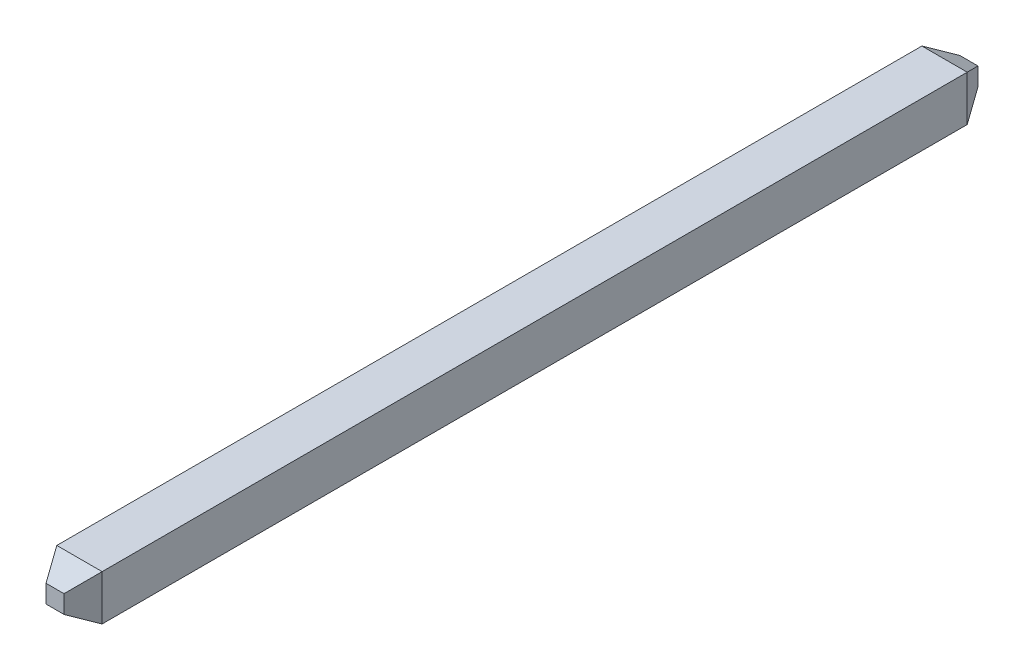
ISO-10303-21;
HEADER;
FILE_DESCRIPTION(('STEP AP214'),'2;1');
FILE_NAME('part.step','',(''),(''),'','','');
FILE_SCHEMA(('AUTOMOTIVE_DESIGN { 1 0 10303 214 1 1 1 1 }'));
ENDSEC;
DATA;
#1=APPLICATION_CONTEXT('core data for automotive mechanical design processes');
#2=APPLICATION_PROTOCOL_DEFINITION('international standard','automotive_design',2000,#1);
#3=PRODUCT_CONTEXT('',#1,'mechanical');
#4=PRODUCT('Part','Part','',(#3));
#5=PRODUCT_RELATED_PRODUCT_CATEGORY('part','',(#4));
#6=PRODUCT_DEFINITION_FORMATION('','',#4);
#7=PRODUCT_DEFINITION_CONTEXT('part definition',#1,'design');
#8=PRODUCT_DEFINITION('design','',#6,#7);
#9=PRODUCT_DEFINITION_SHAPE('','',#8);
#10=(LENGTH_UNIT() NAMED_UNIT(*) SI_UNIT(.MILLI.,.METRE.));
#11=(NAMED_UNIT(*) PLANE_ANGLE_UNIT() SI_UNIT($,.RADIAN.));
#12=(NAMED_UNIT(*) SI_UNIT($,.STERADIAN.) SOLID_ANGLE_UNIT());
#13=UNCERTAINTY_MEASURE_WITH_UNIT(LENGTH_MEASURE(1.E-05),#10,'distance_accuracy_value','');
#14=(GEOMETRIC_REPRESENTATION_CONTEXT(3) GLOBAL_UNCERTAINTY_ASSIGNED_CONTEXT((#13)) GLOBAL_UNIT_ASSIGNED_CONTEXT((#10,
#11,#12)) REPRESENTATION_CONTEXT('',''));
#15=CARTESIAN_POINT('',(0.,0.,0.));
#16=DIRECTION('',(0.,0.,1.));
#17=DIRECTION('',(1.,0.,0.));
#18=AXIS2_PLACEMENT_3D('',#15,#16,#17);
#19=CARTESIAN_POINT('',(0.120115100419239,0.945,-3.20872569516347));
#20=DIRECTION('',(0.872569516347454,0.,-0.488489958076081));
#21=DIRECTION('',(-0.488489958076081,0.,-0.872569516347454));
#22=AXIS2_PLACEMENT_3D('',#19,#20,#21);
#23=PLANE('',#22);
#24=DIRECTION('',(0.,1.,0.));
#25=VECTOR('',#24,1.);
#26=CARTESIAN_POINT('',(0.315341856644683,0.944999999999999,-2.86000017186176));
#27=LINE('',#26,#25);
#28=CARTESIAN_POINT('',(0.315341856632625,0.954999975315067,-2.85999984563027));
#29=VERTEX_POINT('',#28);
#30=CARTESIAN_POINT('',(0.315342017291865,1.58500016035866,-2.8599998849043));
#31=VERTEX_POINT('',#30);
#32=EDGE_CURVE('E118',#29,#31,#27,.T.);
#33=ORIENTED_EDGE('',*,*,#32,.F.);
#34=DIRECTION('',(0.439072617568639,-0.438284036988113,0.784297353956282));
#35=VECTOR('',#34,1.);
#36=CARTESIAN_POINT('',(0.125000000000004,1.145,-3.2));
#37=LINE('',#36,#35);
#38=CARTESIAN_POINT('',(0.125000000000003,1.145,-3.2));
#39=VERTEX_POINT('',#38);
#40=EDGE_CURVE('E116',#39,#29,#37,.T.);
#41=ORIENTED_EDGE('',*,*,#40,.F.);
#42=DIRECTION('',(0.,1.,0.));
#43=VECTOR('',#42,1.);
#44=CARTESIAN_POINT('',(0.125000000000004,1.135,-3.2));
#45=LINE('',#44,#43);
#46=CARTESIAN_POINT('',(0.125000000000003,1.395,-3.2));
#47=VERTEX_POINT('',#46);
#48=EDGE_CURVE('E79',#47,#39,#45,.F.);
#49=ORIENTED_EDGE('',*,*,#48,.F.);
#50=DIRECTION('',(-0.439072617568639,-0.438284036988113,-0.784297353956282));
#51=VECTOR('',#50,1.);
#52=CARTESIAN_POINT('',(0.315341856644679,1.585,-2.86000017186176));
#53=LINE('',#52,#51);
#54=EDGE_CURVE('E110',#31,#47,#53,.T.);
#55=ORIENTED_EDGE('',*,*,#54,.F.);
#56=EDGE_LOOP('',(#33,#41,#49,#55));
#57=FACE_BOUND('',#56,.T.);
#58=ADVANCED_FACE('F17',(#57),#23,.T.);
#59=CARTESIAN_POINT('',(0.12036702814295,0.945,9.50441734607014));
#60=DIRECTION('',(0.873317045523297,0.,0.487152273933377));
#61=DIRECTION('',(0.487152273933377,0.,-0.873317045523297));
#62=AXIS2_PLACEMENT_3D('',#59,#60,#61);
#63=PLANE('',#62);
#64=DIRECTION('',(-0.437799852400895,0.438586917260846,0.784839349959839));
#65=VECTOR('',#64,1.);
#66=CARTESIAN_POINT('',(0.314897899551643,0.954999686828527,9.15568378706484));
#67=LINE('',#66,#65);
#68=CARTESIAN_POINT('',(0.314897654549926,0.954999891076848,9.15568368845102));
#69=VERTEX_POINT('',#68);
#70=CARTESIAN_POINT('',(0.125238550882283,1.145,9.49568417561491));
#71=VERTEX_POINT('',#70);
#72=EDGE_CURVE('E122',#69,#71,#67,.T.);
#73=ORIENTED_EDGE('',*,*,#72,.F.);
#74=DIRECTION('',(0.,1.,0.));
#75=VECTOR('',#74,1.);
#76=CARTESIAN_POINT('',(0.314898539006426,0.944999999999999,9.15568372243698));
#77=LINE('',#76,#75);
#78=CARTESIAN_POINT('',(0.31489765280461,1.5850001770326,9.15568371270385));
#79=VERTEX_POINT('',#78);
#80=EDGE_CURVE('E89',#79,#69,#77,.F.);
#81=ORIENTED_EDGE('',*,*,#80,.F.);
#82=DIRECTION('',(0.437799852400897,0.438586917260845,-0.784839349959839));
#83=VECTOR('',#82,1.);
#84=CARTESIAN_POINT('',(0.125238550882283,1.395,9.49568417561491));
#85=LINE('',#84,#83);
#86=CARTESIAN_POINT('',(0.125238550882283,1.395,9.49568417561491));
#87=VERTEX_POINT('',#86);
#88=EDGE_CURVE('E84',#87,#79,#85,.T.);
#89=ORIENTED_EDGE('',*,*,#88,.F.);
#90=DIRECTION('',(0.,1.,0.));
#91=VECTOR('',#90,1.);
#92=CARTESIAN_POINT('',(0.125238550882283,1.405,9.49568417561491));
#93=LINE('',#92,#91);
#94=EDGE_CURVE('E20',#71,#87,#93,.T.);
#95=ORIENTED_EDGE('',*,*,#94,.F.);
#96=EDGE_LOOP('',(#73,#81,#89,#95));
#97=FACE_BOUND('',#96,.T.);
#98=ADVANCED_FACE('F86',(#97),#63,.T.);
#99=CARTESIAN_POINT('',(-0.134761449117717,1.405,9.49568417561491));
#100=DIRECTION('',(0.,0.,1.));
#101=DIRECTION('',(1.,0.,0.));
#102=AXIS2_PLACEMENT_3D('',#99,#100,#101);
#103=PLANE('',#102);
#104=DIRECTION('',(1.,0.,0.));
#105=VECTOR('',#104,1.);
#106=CARTESIAN_POINT('',(-0.325103305762397,1.395,9.49568417561491));
#107=LINE('',#106,#105);
#108=CARTESIAN_POINT('',(-0.124761449117717,1.395,9.49568417561491));
#109=VERTEX_POINT('',#108);
#110=EDGE_CURVE('E93',#109,#87,#107,.T.);
#111=ORIENTED_EDGE('',*,*,#110,.F.);
#112=DIRECTION('',(0.,1.,0.));
#113=VECTOR('',#112,1.);
#114=CARTESIAN_POINT('',(-0.124761449117719,0.945,9.49568417561491));
#115=LINE('',#114,#113);
#116=CARTESIAN_POINT('',(-0.124761449117718,1.145,9.49568417561491));
#117=VERTEX_POINT('',#116);
#118=EDGE_CURVE('E129',#117,#109,#115,.T.);
#119=ORIENTED_EDGE('',*,*,#118,.F.);
#120=DIRECTION('',(1.,0.,0.));
#121=VECTOR('',#120,1.);
#122=CARTESIAN_POINT('',(-0.325103305762399,1.145,9.49568417561491));
#123=LINE('',#122,#121);
#124=EDGE_CURVE('E98',#71,#117,#123,.F.);
#125=ORIENTED_EDGE('',*,*,#124,.F.);
#126=ORIENTED_EDGE('',*,*,#94,.T.);
#127=EDGE_LOOP('',(#111,#119,#125,#126));
#128=FACE_BOUND('',#127,.T.);
#129=ADVANCED_FACE('F95',(#128),#103,.T.);
#130=CARTESIAN_POINT('',(-0.325103305762397,1.39012178454432,9.50441360938624));
#131=DIRECTION('',(0.,0.872943377132664,0.487821545567864));
#132=DIRECTION('',(0.,-0.487821545567864,0.872943377132664));
#133=AXIS2_PLACEMENT_3D('',#130,#131,#132);
#134=PLANE('',#133);
#135=DIRECTION('',(-0.439072459537935,0.438284700441641,-0.78429707167252));
#136=VECTOR('',#135,1.);
#137=CARTESIAN_POINT('',(-0.124761449117719,1.395,9.49568417561491));
#138=LINE('',#137,#136);
#139=CARTESIAN_POINT('',(-0.315102496297201,1.58500008247257,9.15568447138296));
#140=VERTEX_POINT('',#139);
#141=EDGE_CURVE('E102',#109,#140,#138,.T.);
#142=ORIENTED_EDGE('',*,*,#141,.F.);
#143=ORIENTED_EDGE('',*,*,#110,.T.);
#144=ORIENTED_EDGE('',*,*,#88,.T.);
#145=DIRECTION('',(1.,0.,0.));
#146=VECTOR('',#145,1.);
#147=CARTESIAN_POINT('',(6.65893728155065E-05,1.585,9.15568497320463));
#148=LINE('',#147,#146);
#149=EDGE_CURVE('E131',#140,#79,#148,.T.);
#150=ORIENTED_EDGE('',*,*,#149,.F.);
#151=EDGE_LOOP('',(#142,#143,#144,#150));
#152=FACE_BOUND('',#151,.T.);
#153=ADVANCED_FACE('F100',(#152),#134,.T.);
#154=CARTESIAN_POINT('',(-0.135,1.135,-3.2));
#155=DIRECTION('',(0.,0.,-1.));
#156=DIRECTION('',(-1.,0.,0.));
#157=AXIS2_PLACEMENT_3D('',#154,#155,#156);
#158=PLANE('',#157);
#159=ORIENTED_EDGE('',*,*,#48,.T.);
#160=DIRECTION('',(1.,0.,0.));
#161=VECTOR('',#160,1.);
#162=CARTESIAN_POINT('',(-0.324658143355321,1.145,-3.2));
#163=LINE('',#162,#161);
#164=CARTESIAN_POINT('',(-0.124999999999996,1.145,-3.2));
#165=VERTEX_POINT('',#164);
#166=EDGE_CURVE('E113',#165,#39,#163,.T.);
#167=ORIENTED_EDGE('',*,*,#166,.F.);
#168=DIRECTION('',(0.,1.,0.));
#169=VECTOR('',#168,1.);
#170=CARTESIAN_POINT('',(-0.124999999999998,0.945,-3.2));
#171=LINE('',#170,#169);
#172=CARTESIAN_POINT('',(-0.124999999999996,1.395,-3.2));
#173=VERTEX_POINT('',#172);
#174=EDGE_CURVE('E140',#173,#165,#171,.F.);
#175=ORIENTED_EDGE('',*,*,#174,.F.);
#176=DIRECTION('',(1.,0.,0.));
#177=VECTOR('',#176,1.);
#178=CARTESIAN_POINT('',(-0.32465814335532,1.395,-3.2));
#179=LINE('',#178,#177);
#180=EDGE_CURVE('E105',#47,#173,#179,.F.);
#181=ORIENTED_EDGE('',*,*,#180,.F.);
#182=EDGE_LOOP('',(#159,#167,#175,#181));
#183=FACE_BOUND('',#182,.T.);
#184=ADVANCED_FACE('F184',(#183),#158,.T.);
#185=CARTESIAN_POINT('',(-0.32465814335532,1.58987821545568,-2.85127073809043));
#186=DIRECTION('',(0.,0.872943377132663,-0.487821545567865));
#187=DIRECTION('',(0.,0.487821545567865,0.872943377132663));
#188=AXIS2_PLACEMENT_3D('',#185,#186,#187);
#189=PLANE('',#188);
#190=DIRECTION('',(1.,0.,0.));
#191=VECTOR('',#190,1.);
#192=CARTESIAN_POINT('',(6.65893728155065E-05,1.585,-2.86000017186176));
#193=LINE('',#192,#191);
#194=CARTESIAN_POINT('',(-0.314658552313813,1.5850007068091,-2.8599984305592));
#195=VERTEX_POINT('',#194);
#196=EDGE_CURVE('E137',#31,#195,#193,.F.);
#197=ORIENTED_EDGE('',*,*,#196,.F.);
#198=ORIENTED_EDGE('',*,*,#54,.T.);
#199=ORIENTED_EDGE('',*,*,#180,.T.);
#200=DIRECTION('',(0.437798396819594,-0.438586429089658,-0.784840434713054));
#201=VECTOR('',#200,1.);
#202=CARTESIAN_POINT('',(-0.314659335924682,1.58500072063078,-2.85999803394471));
#203=LINE('',#202,#201);
#204=EDGE_CURVE('E145',#195,#173,#203,.T.);
#205=ORIENTED_EDGE('',*,*,#204,.F.);
#206=EDGE_LOOP('',(#197,#198,#199,#205));
#207=FACE_BOUND('',#206,.T.);
#208=ADVANCED_FACE('F182',(#207),#189,.T.);
#209=CARTESIAN_POINT('',(-0.324658143355321,1.14987821545568,-3.20872943377133));
#210=DIRECTION('',(0.,-0.872943377132663,-0.487821545567865));
#211=DIRECTION('',(0.,0.487821545567865,-0.872943377132663));
#212=AXIS2_PLACEMENT_3D('',#209,#210,#211);
#213=PLANE('',#212);
#214=ORIENTED_EDGE('',*,*,#166,.T.);
#215=ORIENTED_EDGE('',*,*,#40,.T.);
#216=DIRECTION('',(1.,0.,0.));
#217=VECTOR('',#216,1.);
#218=CARTESIAN_POINT('',(-0.325051653144535,0.955,-2.85999756200982));
#219=LINE('',#218,#217);
#220=CARTESIAN_POINT('',(-0.314658017815116,0.954999729763457,-2.85999898491791));
#221=VERTEX_POINT('',#220);
#222=EDGE_CURVE('E35',#221,#29,#219,.T.);
#223=ORIENTED_EDGE('',*,*,#222,.F.);
#224=DIRECTION('',(-0.437798396819593,-0.438586429089662,0.784840434713052));
#225=VECTOR('',#224,1.);
#226=CARTESIAN_POINT('',(-0.124999999999998,1.145,-3.2));
#227=LINE('',#226,#225);
#228=EDGE_CURVE('E143',#165,#221,#227,.T.);
#229=ORIENTED_EDGE('',*,*,#228,.F.);
#230=EDGE_LOOP('',(#214,#215,#223,#229));
#231=FACE_BOUND('',#230,.T.);
#232=ADVANCED_FACE('F185',(#231),#213,.T.);
#233=CARTESIAN_POINT('',(0.315346308268754,0.944999999999999,-2.98065701705514));
#234=DIRECTION('',(0.999999999319383,0.,3.68949151671738E-05));
#235=DIRECTION('',(3.68949151671738E-05,0.,-0.999999999319383));
#236=AXIS2_PLACEMENT_3D('',#233,#234,#235);
#237=PLANE('',#236);
#238=DIRECTION('',(3.69481335093583E-05,0.,-0.999999999317418));
#239=VECTOR('',#238,1.);
#240=CARTESIAN_POINT('',(0.314897899551644,1.585,9.15568372241339));
#241=LINE('',#240,#239);
#242=EDGE_CURVE('E134',#79,#31,#241,.T.);
#243=ORIENTED_EDGE('',*,*,#242,.F.);
#244=ORIENTED_EDGE('',*,*,#80,.T.);
#245=DIRECTION('',(-3.69481335094485E-05,0.,0.999999999317418));
#246=VECTOR('',#245,1.);
#247=CARTESIAN_POINT('',(0.315341856644679,0.955,-2.86000017186176));
#248=LINE('',#247,#246);
#249=EDGE_CURVE('E149',#29,#69,#248,.T.);
#250=ORIENTED_EDGE('',*,*,#249,.F.);
#251=ORIENTED_EDGE('',*,*,#32,.T.);
#252=EDGE_LOOP('',(#243,#244,#250,#251));
#253=FACE_BOUND('',#252,.T.);
#254=ADVANCED_FACE('F187',(#253),#237,.T.);
#255=CARTESIAN_POINT('',(-0.325103305762399,0.950121784544321,9.14695491370534));
#256=DIRECTION('',(0.,-0.872943377132664,0.487821545567865));
#257=DIRECTION('',(0.,-0.487821545567865,-0.872943377132664));
#258=AXIS2_PLACEMENT_3D('',#255,#256,#257);
#259=PLANE('',#258);
#260=ORIENTED_EDGE('',*,*,#124,.T.);
#261=DIRECTION('',(0.439072459537931,0.438284700441657,0.784297071672513));
#262=VECTOR('',#261,1.);
#263=CARTESIAN_POINT('',(-0.315102751134454,0.955000197635095,9.15568533818575));
#264=LINE('',#263,#262);
#265=CARTESIAN_POINT('',(-0.315102182397624,0.955000116075707,9.15568487573228));
#266=VERTEX_POINT('',#265);
#267=EDGE_CURVE('E126',#266,#117,#264,.T.);
#268=ORIENTED_EDGE('',*,*,#267,.F.);
#269=DIRECTION('',(1.,0.,0.));
#270=VECTOR('',#269,1.);
#271=CARTESIAN_POINT('',(-0.325051653144535,0.955,9.15568372241339));
#272=LINE('',#271,#270);
#273=EDGE_CURVE('E152',#69,#266,#272,.F.);
#274=ORIENTED_EDGE('',*,*,#273,.F.);
#275=ORIENTED_EDGE('',*,*,#72,.T.);
#276=EDGE_LOOP('',(#260,#268,#274,#275));
#277=FACE_BOUND('',#276,.T.);
#278=ADVANCED_FACE('F174',(#277),#259,.T.);
#279=CARTESIAN_POINT('',(-0.119876549536956,0.945,9.50440987077839));
#280=DIRECTION('',(-0.872569516347453,0.,0.488489958076082));
#281=DIRECTION('',(0.488489958076082,0.,0.872569516347453));
#282=AXIS2_PLACEMENT_3D('',#279,#280,#281);
#283=PLANE('',#282);
#284=ORIENTED_EDGE('',*,*,#267,.T.);
#285=ORIENTED_EDGE('',*,*,#118,.T.);
#286=ORIENTED_EDGE('',*,*,#141,.T.);
#287=DIRECTION('',(0.,1.,0.));
#288=VECTOR('',#287,1.);
#289=CARTESIAN_POINT('',(-0.315101461039725,0.945,9.15568497322818));
#290=LINE('',#289,#288);
#291=EDGE_CURVE('E155',#266,#140,#290,.T.);
#292=ORIENTED_EDGE('',*,*,#291,.F.);
#293=EDGE_LOOP('',(#284,#285,#286,#292));
#294=FACE_BOUND('',#293,.T.);
#295=ADVANCED_FACE('F177',(#294),#283,.T.);
#296=CARTESIAN_POINT('',(6.65893728155065E-05,1.585,9.32634470275115));
#297=DIRECTION('',(0.,1.,0.));
#298=DIRECTION('',(0.,0.,1.));
#299=AXIS2_PLACEMENT_3D('',#296,#297,#298);
#300=PLANE('',#299);
#301=ORIENTED_EDGE('',*,*,#196,.T.);
#302=DIRECTION('',(-3.68949151674615E-05,0.,0.999999999319383));
#303=VECTOR('',#302,1.);
#304=CARTESIAN_POINT('',(-0.31510775764562,1.5849998023649,9.32634821671993));
#305=LINE('',#304,#303);
#306=EDGE_CURVE('E158',#140,#195,#305,.F.);
#307=ORIENTED_EDGE('',*,*,#306,.F.);
#308=ORIENTED_EDGE('',*,*,#149,.T.);
#309=ORIENTED_EDGE('',*,*,#242,.T.);
#310=EDGE_LOOP('',(#301,#307,#308,#309));
#311=FACE_BOUND('',#310,.T.);
#312=ADVANCED_FACE('F179',(#311),#300,.T.);
#313=CARTESIAN_POINT('',(-0.120128477260666,0.945,-3.20873317045523));
#314=DIRECTION('',(-0.873317045523297,0.,-0.487152273933376));
#315=DIRECTION('',(-0.487152273933376,0.,0.873317045523297));
#316=AXIS2_PLACEMENT_3D('',#313,#314,#315);
#317=PLANE('',#316);
#318=DIRECTION('',(0.,1.,0.));
#319=VECTOR('',#318,1.);
#320=CARTESIAN_POINT('',(-0.314658143451607,0.945,-2.85999756199704));
#321=LINE('',#320,#319);
#322=EDGE_CURVE('E26',#195,#221,#321,.F.);
#323=ORIENTED_EDGE('',*,*,#322,.F.);
#324=ORIENTED_EDGE('',*,*,#204,.T.);
#325=ORIENTED_EDGE('',*,*,#174,.T.);
#326=ORIENTED_EDGE('',*,*,#228,.T.);
#327=EDGE_LOOP('',(#323,#324,#325,#326));
#328=FACE_BOUND('',#327,.T.);
#329=ADVANCED_FACE('F168',(#328),#317,.T.);
#330=CARTESIAN_POINT('',(-0.325051653144535,0.955,3.17284922525592));
#331=DIRECTION('',(0.,-1.,0.));
#332=DIRECTION('',(0.,0.,-1.));
#333=AXIS2_PLACEMENT_3D('',#330,#331,#332);
#334=PLANE('',#333);
#335=ORIENTED_EDGE('',*,*,#249,.T.);
#336=ORIENTED_EDGE('',*,*,#273,.T.);
#337=DIRECTION('',(-3.68949151674615E-05,0.,0.999999999319383));
#338=VECTOR('',#337,1.);
#339=CARTESIAN_POINT('',(-0.31510775764562,0.954999279369218,9.32634821671993));
#340=LINE('',#339,#338);
#341=EDGE_CURVE('E11',#221,#266,#340,.T.);
#342=ORIENTED_EDGE('',*,*,#341,.F.);
#343=ORIENTED_EDGE('',*,*,#222,.T.);
#344=EDGE_LOOP('',(#335,#336,#342,#343));
#345=FACE_BOUND('',#344,.T.);
#346=ADVANCED_FACE('F170',(#345),#334,.T.);
#347=CARTESIAN_POINT('',(-0.31510775764562,0.945,9.32634821671993));
#348=DIRECTION('',(-0.999999999319383,0.,-3.68949151674615E-05));
#349=DIRECTION('',(-3.68949151674615E-05,0.,0.999999999319383));
#350=AXIS2_PLACEMENT_3D('',#347,#348,#349);
#351=PLANE('',#350);
#352=ORIENTED_EDGE('',*,*,#322,.T.);
#353=ORIENTED_EDGE('',*,*,#341,.T.);
#354=ORIENTED_EDGE('',*,*,#291,.T.);
#355=ORIENTED_EDGE('',*,*,#306,.T.);
#356=EDGE_LOOP('',(#352,#353,#354,#355));
#357=FACE_BOUND('',#356,.T.);
#358=ADVANCED_FACE('F164',(#357),#351,.T.);
#359=CLOSED_SHELL('',(#58,#98,#129,#153,#184,#208,#232,#254,#278,#295,#312,#329,#346,#358));
#360=MANIFOLD_SOLID_BREP('B1',#359);
#361=ADVANCED_BREP_SHAPE_REPRESENTATION('',(#18,#360),#14);
#362=SHAPE_DEFINITION_REPRESENTATION(#9,#361);
ENDSEC;
END-ISO-10303-21;
